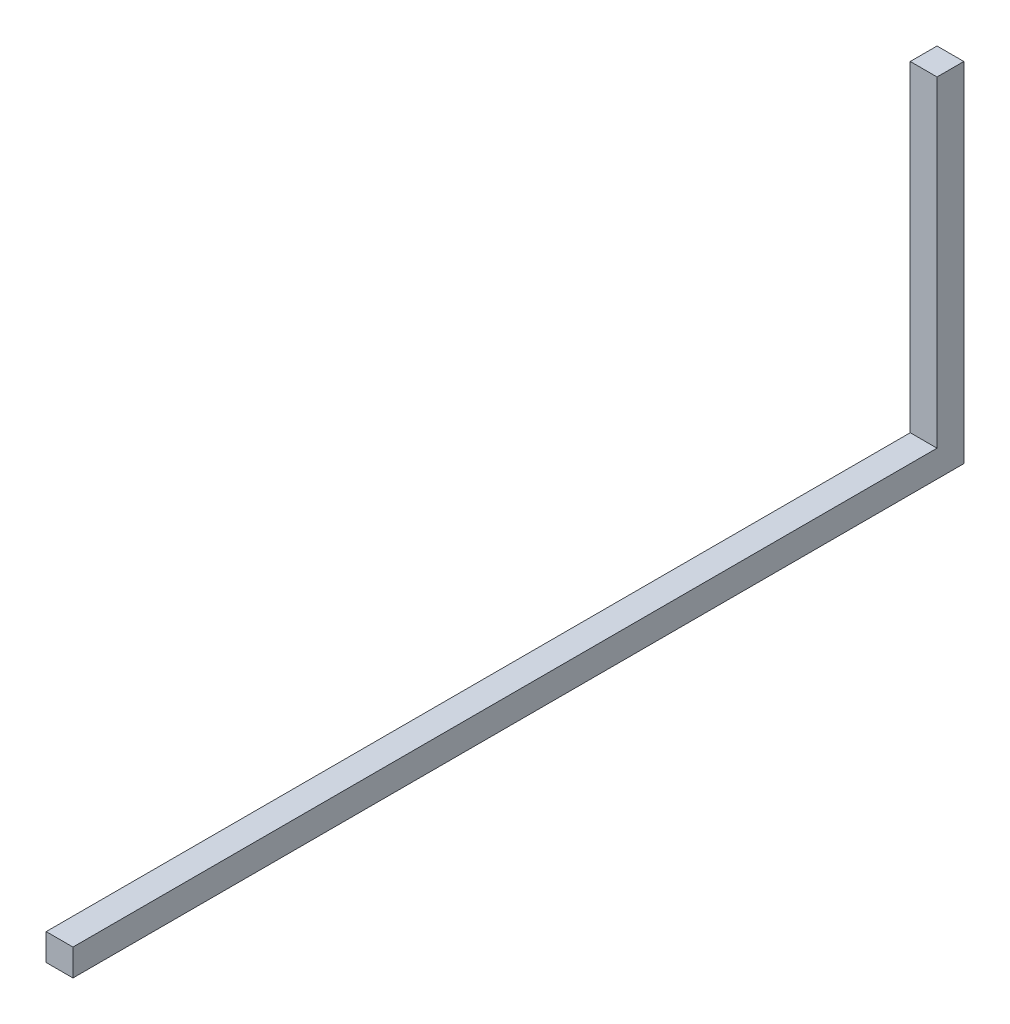
ISO-10303-21;
HEADER;
FILE_DESCRIPTION(('STEP AP214'),'2;1');
FILE_NAME('part.step','',(''),(''),'','','');
FILE_SCHEMA(('AUTOMOTIVE_DESIGN { 1 0 10303 214 1 1 1 1 }'));
ENDSEC;
DATA;
#1=APPLICATION_CONTEXT('core data for automotive mechanical design processes');
#2=APPLICATION_PROTOCOL_DEFINITION('international standard','automotive_design',2000,#1);
#3=PRODUCT_CONTEXT('',#1,'mechanical');
#4=PRODUCT('Part','Part','',(#3));
#5=PRODUCT_RELATED_PRODUCT_CATEGORY('part','',(#4));
#6=PRODUCT_DEFINITION_FORMATION('','',#4);
#7=PRODUCT_DEFINITION_CONTEXT('part definition',#1,'design');
#8=PRODUCT_DEFINITION('design','',#6,#7);
#9=PRODUCT_DEFINITION_SHAPE('','',#8);
#10=(LENGTH_UNIT() NAMED_UNIT(*) SI_UNIT(.MILLI.,.METRE.));
#11=(NAMED_UNIT(*) PLANE_ANGLE_UNIT() SI_UNIT($,.RADIAN.));
#12=(NAMED_UNIT(*) SI_UNIT($,.STERADIAN.) SOLID_ANGLE_UNIT());
#13=UNCERTAINTY_MEASURE_WITH_UNIT(LENGTH_MEASURE(1.E-05),#10,'distance_accuracy_value','');
#14=(GEOMETRIC_REPRESENTATION_CONTEXT(3) GLOBAL_UNCERTAINTY_ASSIGNED_CONTEXT((#13)) GLOBAL_UNIT_ASSIGNED_CONTEXT((#10,
#11,#12)) REPRESENTATION_CONTEXT('',''));
#15=CARTESIAN_POINT('',(0.,0.,0.));
#16=DIRECTION('',(0.,0.,1.));
#17=DIRECTION('',(1.,0.,0.));
#18=AXIS2_PLACEMENT_3D('',#15,#16,#17);
#19=CARTESIAN_POINT('',(-0.2,-0.2,-13.3));
#20=DIRECTION('',(0.,0.,1.));
#21=DIRECTION('',(1.,0.,0.));
#22=AXIS2_PLACEMENT_3D('',#19,#20,#21);
#23=PLANE('',#22);
#24=DIRECTION('',(-1.,0.,0.));
#25=VECTOR('',#24,1.);
#26=CARTESIAN_POINT('',(-0.2,5.,-13.3));
#27=LINE('',#26,#25);
#28=CARTESIAN_POINT('',(0.2,5.,-13.3));
#29=VERTEX_POINT('',#28);
#30=CARTESIAN_POINT('',(-0.2,5.,-13.3));
#31=VERTEX_POINT('',#30);
#32=EDGE_CURVE('E129',#29,#31,#27,.T.);
#33=ORIENTED_EDGE('',*,*,#32,.F.);
#34=DIRECTION('',(0.,1.,0.));
#35=VECTOR('',#34,1.);
#36=CARTESIAN_POINT('',(0.2,-0.2,-13.3));
#37=LINE('',#36,#35);
#38=CARTESIAN_POINT('',(0.2,-0.2,-13.3));
#39=VERTEX_POINT('',#38);
#40=EDGE_CURVE('E120',#39,#29,#37,.T.);
#41=ORIENTED_EDGE('',*,*,#40,.F.);
#42=DIRECTION('',(1.,0.,0.));
#43=VECTOR('',#42,1.);
#44=CARTESIAN_POINT('',(-0.2,-0.2,-13.3));
#45=LINE('',#44,#43);
#46=CARTESIAN_POINT('',(-0.2,-0.2,-13.3));
#47=VERTEX_POINT('',#46);
#48=EDGE_CURVE('E109',#47,#39,#45,.T.);
#49=ORIENTED_EDGE('',*,*,#48,.F.);
#50=DIRECTION('',(0.,1.,0.));
#51=VECTOR('',#50,1.);
#52=CARTESIAN_POINT('',(-0.2,-0.2,-13.3));
#53=LINE('',#52,#51);
#54=EDGE_CURVE('E89',#47,#31,#53,.T.);
#55=ORIENTED_EDGE('',*,*,#54,.T.);
#56=EDGE_LOOP('',(#33,#41,#49,#55));
#57=FACE_BOUND('',#56,.T.);
#58=ADVANCED_FACE('F33',(#57),#23,.F.);
#59=CARTESIAN_POINT('',(-0.2,0.2,-12.9));
#60=DIRECTION('',(0.,0.,-1.));
#61=DIRECTION('',(-1.,0.,0.));
#62=AXIS2_PLACEMENT_3D('',#59,#60,#61);
#63=PLANE('',#62);
#64=DIRECTION('',(1.,0.,0.));
#65=VECTOR('',#64,1.);
#66=CARTESIAN_POINT('',(-0.2,5.,-12.9));
#67=LINE('',#66,#65);
#68=CARTESIAN_POINT('',(-0.2,5.,-12.9));
#69=VERTEX_POINT('',#68);
#70=CARTESIAN_POINT('',(0.2,5.,-12.9));
#71=VERTEX_POINT('',#70);
#72=EDGE_CURVE('E12',#69,#71,#67,.T.);
#73=ORIENTED_EDGE('',*,*,#72,.F.);
#74=DIRECTION('',(0.,1.,0.));
#75=VECTOR('',#74,1.);
#76=CARTESIAN_POINT('',(-0.2,0.2,-12.9));
#77=LINE('',#76,#75);
#78=CARTESIAN_POINT('',(-0.2,0.2,-12.9));
#79=VERTEX_POINT('',#78);
#80=EDGE_CURVE('E126',#79,#69,#77,.T.);
#81=ORIENTED_EDGE('',*,*,#80,.F.);
#82=DIRECTION('',(-1.,0.,0.));
#83=VECTOR('',#82,1.);
#84=CARTESIAN_POINT('',(-0.2,0.2,-12.9));
#85=LINE('',#84,#83);
#86=CARTESIAN_POINT('',(0.2,0.2,-12.9));
#87=VERTEX_POINT('',#86);
#88=EDGE_CURVE('E121',#87,#79,#85,.T.);
#89=ORIENTED_EDGE('',*,*,#88,.F.);
#90=DIRECTION('',(0.,1.,0.));
#91=VECTOR('',#90,1.);
#92=CARTESIAN_POINT('',(0.2,0.2,-12.9));
#93=LINE('',#92,#91);
#94=EDGE_CURVE('E124',#87,#71,#93,.T.);
#95=ORIENTED_EDGE('',*,*,#94,.T.);
#96=EDGE_LOOP('',(#73,#81,#89,#95));
#97=FACE_BOUND('',#96,.T.);
#98=ADVANCED_FACE('F35',(#97),#63,.F.);
#99=CARTESIAN_POINT('',(0.,0.,0.));
#100=DIRECTION('',(0.,0.,-1.));
#101=DIRECTION('',(-1.,0.,0.));
#102=AXIS2_PLACEMENT_3D('',#99,#100,#101);
#103=PLANE('',#102);
#104=DIRECTION('',(0.,-1.,0.));
#105=VECTOR('',#104,1.);
#106=CARTESIAN_POINT('',(-0.2,-0.2,0.));
#107=LINE('',#106,#105);
#108=CARTESIAN_POINT('',(-0.2,0.2,0.));
#109=VERTEX_POINT('',#108);
#110=CARTESIAN_POINT('',(-0.2,-0.2,0.));
#111=VERTEX_POINT('',#110);
#112=EDGE_CURVE('E85',#109,#111,#107,.T.);
#113=ORIENTED_EDGE('',*,*,#112,.T.);
#114=DIRECTION('',(1.,0.,0.));
#115=VECTOR('',#114,1.);
#116=CARTESIAN_POINT('',(-0.2,-0.2,0.));
#117=LINE('',#116,#115);
#118=CARTESIAN_POINT('',(0.2,-0.2,0.));
#119=VERTEX_POINT('',#118);
#120=EDGE_CURVE('E97',#111,#119,#117,.T.);
#121=ORIENTED_EDGE('',*,*,#120,.T.);
#122=DIRECTION('',(0.,1.,0.));
#123=VECTOR('',#122,1.);
#124=CARTESIAN_POINT('',(0.2,-0.2,0.));
#125=LINE('',#124,#123);
#126=CARTESIAN_POINT('',(0.2,0.2,0.));
#127=VERTEX_POINT('',#126);
#128=EDGE_CURVE('E103',#119,#127,#125,.T.);
#129=ORIENTED_EDGE('',*,*,#128,.T.);
#130=DIRECTION('',(-1.,0.,0.));
#131=VECTOR('',#130,1.);
#132=CARTESIAN_POINT('',(-0.2,0.2,0.));
#133=LINE('',#132,#131);
#134=EDGE_CURVE('E94',#127,#109,#133,.T.);
#135=ORIENTED_EDGE('',*,*,#134,.T.);
#136=EDGE_LOOP('',(#113,#121,#129,#135));
#137=FACE_BOUND('',#136,.T.);
#138=ADVANCED_FACE('F105',(#137),#103,.F.);
#139=CARTESIAN_POINT('',(-0.2,-0.2,-13.6656854249492));
#140=DIRECTION('',(-1.,0.,0.));
#141=DIRECTION('',(0.,0.,1.));
#142=AXIS2_PLACEMENT_3D('',#139,#140,#141);
#143=PLANE('',#142);
#144=DIRECTION('',(0.,0.,1.));
#145=VECTOR('',#144,1.);
#146=CARTESIAN_POINT('',(-0.2,0.2,-13.6656854249492));
#147=LINE('',#146,#145);
#148=EDGE_CURVE('E114',#79,#109,#147,.T.);
#149=ORIENTED_EDGE('',*,*,#148,.F.);
#150=ORIENTED_EDGE('',*,*,#80,.T.);
#151=DIRECTION('',(0.,0.,1.));
#152=VECTOR('',#151,1.);
#153=CARTESIAN_POINT('',(-0.2,5.,-13.4828427124746));
#154=LINE('',#153,#152);
#155=EDGE_CURVE('E42',#31,#69,#154,.T.);
#156=ORIENTED_EDGE('',*,*,#155,.F.);
#157=ORIENTED_EDGE('',*,*,#54,.F.);
#158=DIRECTION('',(0.,0.,1.));
#159=VECTOR('',#158,1.);
#160=CARTESIAN_POINT('',(-0.2,-0.2,-13.6656854249492));
#161=LINE('',#160,#159);
#162=EDGE_CURVE('E80',#47,#111,#161,.T.);
#163=ORIENTED_EDGE('',*,*,#162,.T.);
#164=ORIENTED_EDGE('',*,*,#112,.F.);
#165=EDGE_LOOP('',(#149,#150,#156,#157,#163,#164));
#166=FACE_BOUND('',#165,.T.);
#167=ADVANCED_FACE('F83',(#166),#143,.T.);
#168=CARTESIAN_POINT('',(-0.2,0.2,-13.6656854249492));
#169=DIRECTION('',(0.,1.,0.));
#170=DIRECTION('',(0.,0.,1.));
#171=AXIS2_PLACEMENT_3D('',#168,#169,#170);
#172=PLANE('',#171);
#173=DIRECTION('',(0.,0.,1.));
#174=VECTOR('',#173,1.);
#175=CARTESIAN_POINT('',(0.2,0.2,-13.6656854249492));
#176=LINE('',#175,#174);
#177=EDGE_CURVE('E116',#87,#127,#176,.T.);
#178=ORIENTED_EDGE('',*,*,#177,.F.);
#179=ORIENTED_EDGE('',*,*,#88,.T.);
#180=ORIENTED_EDGE('',*,*,#148,.T.);
#181=ORIENTED_EDGE('',*,*,#134,.F.);
#182=EDGE_LOOP('',(#178,#179,#180,#181));
#183=FACE_BOUND('',#182,.T.);
#184=ADVANCED_FACE('F141',(#183),#172,.T.);
#185=CARTESIAN_POINT('',(0.2,-0.2,-13.6656854249492));
#186=DIRECTION('',(1.,0.,0.));
#187=DIRECTION('',(0.,0.,-1.));
#188=AXIS2_PLACEMENT_3D('',#185,#186,#187);
#189=PLANE('',#188);
#190=DIRECTION('',(0.,0.,1.));
#191=VECTOR('',#190,1.);
#192=CARTESIAN_POINT('',(0.2,-0.2,-13.6656854249492));
#193=LINE('',#192,#191);
#194=EDGE_CURVE('E93',#39,#119,#193,.T.);
#195=ORIENTED_EDGE('',*,*,#194,.F.);
#196=ORIENTED_EDGE('',*,*,#40,.T.);
#197=DIRECTION('',(0.,0.,-1.));
#198=VECTOR('',#197,1.);
#199=CARTESIAN_POINT('',(0.2,5.,-13.4828427124746));
#200=LINE('',#199,#198);
#201=EDGE_CURVE('E128',#71,#29,#200,.T.);
#202=ORIENTED_EDGE('',*,*,#201,.F.);
#203=ORIENTED_EDGE('',*,*,#94,.F.);
#204=ORIENTED_EDGE('',*,*,#177,.T.);
#205=ORIENTED_EDGE('',*,*,#128,.F.);
#206=EDGE_LOOP('',(#195,#196,#202,#203,#204,#205));
#207=FACE_BOUND('',#206,.T.);
#208=ADVANCED_FACE('F140',(#207),#189,.T.);
#209=CARTESIAN_POINT('',(-0.2,-0.2,-13.6656854249492));
#210=DIRECTION('',(0.,-1.,0.));
#211=DIRECTION('',(0.,0.,-1.));
#212=AXIS2_PLACEMENT_3D('',#209,#210,#211);
#213=PLANE('',#212);
#214=ORIENTED_EDGE('',*,*,#162,.F.);
#215=ORIENTED_EDGE('',*,*,#48,.T.);
#216=ORIENTED_EDGE('',*,*,#194,.T.);
#217=ORIENTED_EDGE('',*,*,#120,.F.);
#218=EDGE_LOOP('',(#214,#215,#216,#217));
#219=FACE_BOUND('',#218,.T.);
#220=ADVANCED_FACE('F98',(#219),#213,.T.);
#221=CARTESIAN_POINT('',(0.,5.,-13.1));
#222=DIRECTION('',(0.,1.,0.));
#223=DIRECTION('',(0.,0.,1.));
#224=AXIS2_PLACEMENT_3D('',#221,#222,#223);
#225=PLANE('',#224);
#226=ORIENTED_EDGE('',*,*,#155,.T.);
#227=ORIENTED_EDGE('',*,*,#72,.T.);
#228=ORIENTED_EDGE('',*,*,#201,.T.);
#229=ORIENTED_EDGE('',*,*,#32,.T.);
#230=EDGE_LOOP('',(#226,#227,#228,#229));
#231=FACE_BOUND('',#230,.T.);
#232=ADVANCED_FACE('F158',(#231),#225,.T.);
#233=CLOSED_SHELL('',(#58,#98,#138,#167,#184,#208,#220,#232));
#234=MANIFOLD_SOLID_BREP('B2',#233);
#235=ADVANCED_BREP_SHAPE_REPRESENTATION('',(#18,#234),#14);
#236=SHAPE_DEFINITION_REPRESENTATION(#9,#235);
ENDSEC;
END-ISO-10303-21;
